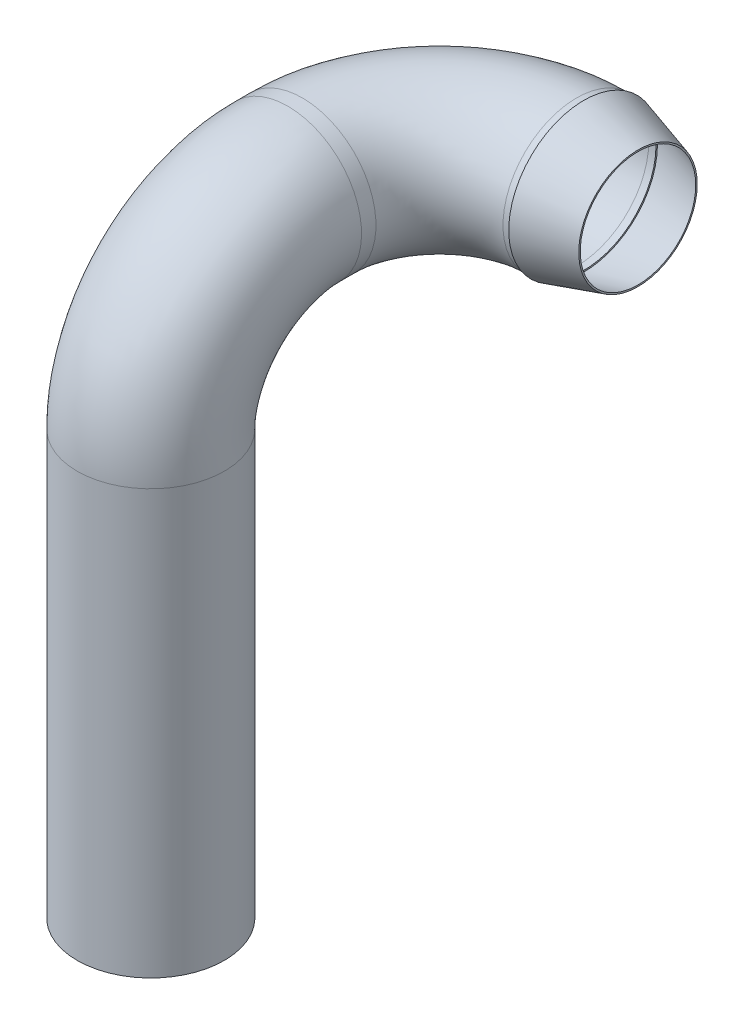
ISO-10303-21;
HEADER;
FILE_DESCRIPTION(('STEP AP214'),'2;1');
FILE_NAME('part.step','',(''),(''),'','','');
FILE_SCHEMA(('AUTOMOTIVE_DESIGN { 1 0 10303 214 1 1 1 1 }'));
ENDSEC;
DATA;
#1=APPLICATION_CONTEXT('core data for automotive mechanical design processes');
#2=APPLICATION_PROTOCOL_DEFINITION('international standard','automotive_design',2000,#1);
#3=PRODUCT_CONTEXT('',#1,'mechanical');
#4=PRODUCT('Part','Part','',(#3));
#5=PRODUCT_RELATED_PRODUCT_CATEGORY('part','',(#4));
#6=PRODUCT_DEFINITION_FORMATION('','',#4);
#7=PRODUCT_DEFINITION_CONTEXT('part definition',#1,'design');
#8=PRODUCT_DEFINITION('design','',#6,#7);
#9=PRODUCT_DEFINITION_SHAPE('','',#8);
#10=(LENGTH_UNIT() NAMED_UNIT(*) SI_UNIT(.MILLI.,.METRE.));
#11=(NAMED_UNIT(*) PLANE_ANGLE_UNIT() SI_UNIT($,.RADIAN.));
#12=(NAMED_UNIT(*) SI_UNIT($,.STERADIAN.) SOLID_ANGLE_UNIT());
#13=UNCERTAINTY_MEASURE_WITH_UNIT(LENGTH_MEASURE(1.E-05),#10,'distance_accuracy_value','');
#14=(GEOMETRIC_REPRESENTATION_CONTEXT(3) GLOBAL_UNCERTAINTY_ASSIGNED_CONTEXT((#13)) GLOBAL_UNIT_ASSIGNED_CONTEXT((#10,
#11,#12)) REPRESENTATION_CONTEXT('',''));
#15=CARTESIAN_POINT('',(0.,0.,0.));
#16=DIRECTION('',(0.,0.,1.));
#17=DIRECTION('',(1.,0.,0.));
#18=AXIS2_PLACEMENT_3D('',#15,#16,#17);
#19=CARTESIAN_POINT('',(199.999999999999,777.,-400.));
#20=DIRECTION('',(1.,0.,0.));
#21=DIRECTION('',(0.,0.,-1.));
#22=AXIS2_PLACEMENT_3D('',#19,#20,#21);
#23=PLANE('',#22);
#24=CARTESIAN_POINT('',(199.999999999999,777.,-400.));
#25=DIRECTION('',(1.,0.,0.));
#26=DIRECTION('',(0.,0.,-1.));
#27=AXIS2_PLACEMENT_3D('',#24,#25,#26);
#28=CIRCLE('',#27,104.084269123165);
#29=CARTESIAN_POINT('',(199.999999999999,777.,-504.084269123165));
#30=VERTEX_POINT('',#29);
#31=EDGE_CURVE('E70',#30,#30,#28,.T.);
#32=ORIENTED_EDGE('',*,*,#31,.F.);
#33=EDGE_LOOP('',(#32));
#34=FACE_BOUND('',#33,.T.);
#35=CARTESIAN_POINT('',(199.999999999999,777.,-400.));
#36=DIRECTION('',(1.,0.,0.));
#37=DIRECTION('',(0.,0.,-1.));
#38=AXIS2_PLACEMENT_3D('',#35,#36,#37);
#39=CIRCLE('',#38,102.);
#40=CARTESIAN_POINT('',(199.999999999999,777.,-502.));
#41=VERTEX_POINT('',#40);
#42=EDGE_CURVE('E78',#41,#41,#39,.T.);
#43=ORIENTED_EDGE('',*,*,#42,.T.);
#44=EDGE_LOOP('',(#43));
#45=FACE_BOUND('',#44,.T.);
#46=ADVANCED_FACE('F63',(#34,#45),#23,.F.);
#47=CARTESIAN_POINT('',(274.999999999999,777.,-400.));
#48=DIRECTION('',(1.,0.,0.));
#49=DIRECTION('',(0.,0.,-1.));
#50=AXIS2_PLACEMENT_3D('',#47,#48,#49);
#51=PLANE('',#50);
#52=CARTESIAN_POINT('',(274.999999999999,777.,-400.));
#53=DIRECTION('',(1.,0.,0.));
#54=DIRECTION('',(0.,0.,-1.));
#55=AXIS2_PLACEMENT_3D('',#52,#53,#54);
#56=CIRCLE('',#55,80.);
#57=CARTESIAN_POINT('',(274.999999999999,777.,-480.));
#58=VERTEX_POINT('',#57);
#59=EDGE_CURVE('E74',#58,#58,#56,.T.);
#60=ORIENTED_EDGE('',*,*,#59,.F.);
#61=EDGE_LOOP('',(#60));
#62=FACE_BOUND('',#61,.T.);
#63=CARTESIAN_POINT('',(274.999999999999,777.,-400.));
#64=DIRECTION('',(1.,0.,0.));
#65=DIRECTION('',(0.,0.,-1.));
#66=AXIS2_PLACEMENT_3D('',#63,#64,#65);
#67=CIRCLE('',#66,82.0842691231647);
#68=CARTESIAN_POINT('',(274.999999999999,777.,-482.084269123165));
#69=VERTEX_POINT('',#68);
#70=EDGE_CURVE('E12',#69,#69,#67,.T.);
#71=ORIENTED_EDGE('',*,*,#70,.T.);
#72=EDGE_LOOP('',(#71));
#73=FACE_BOUND('',#72,.T.);
#74=ADVANCED_FACE('F91',(#62,#73),#51,.T.);
#75=CARTESIAN_POINT('',(275.562947135901,777.,-400.));
#76=DIRECTION('',(-1.,0.,0.));
#77=DIRECTION('',(0.,0.,1.));
#78=AXIS2_PLACEMENT_3D('',#75,#76,#77);
#79=CONICAL_SURFACE('',#78,81.9191379633003,0.285329420182135);
#80=ORIENTED_EDGE('',*,*,#31,.T.);
#81=EDGE_LOOP('',(#80));
#82=FACE_BOUND('',#81,.T.);
#83=ORIENTED_EDGE('',*,*,#70,.F.);
#84=EDGE_LOOP('',(#83));
#85=FACE_BOUND('',#84,.T.);
#86=ADVANCED_FACE('F65',(#82,#85),#79,.T.);
#87=CARTESIAN_POINT('',(274.999999999999,777.,-400.));
#88=DIRECTION('',(-1.,0.,0.));
#89=DIRECTION('',(0.,0.,1.));
#90=AXIS2_PLACEMENT_3D('',#87,#88,#89);
#91=CONICAL_SURFACE('',#90,80.,0.285329420182135);
#92=ORIENTED_EDGE('',*,*,#42,.F.);
#93=EDGE_LOOP('',(#92));
#94=FACE_BOUND('',#93,.T.);
#95=ORIENTED_EDGE('',*,*,#59,.T.);
#96=EDGE_LOOP('',(#95));
#97=FACE_BOUND('',#96,.T.);
#98=ADVANCED_FACE('F85',(#94,#97),#91,.F.);
#99=CLOSED_SHELL('',(#46,#74,#86,#98));
#100=MANIFOLD_SOLID_BREP('B2',#99);
#101=CARTESIAN_POINT('',(0.,0.,0.));
#102=DIRECTION('',(0.,1.,0.));
#103=DIRECTION('',(0.,0.,1.));
#104=AXIS2_PLACEMENT_3D('',#101,#102,#103);
#105=PLANE('',#104);
#106=CARTESIAN_POINT('',(0.,0.,0.));
#107=DIRECTION('',(0.,1.,0.));
#108=DIRECTION('',(0.,0.,1.));
#109=AXIS2_PLACEMENT_3D('',#106,#107,#108);
#110=CIRCLE('',#109,100.);
#111=CARTESIAN_POINT('',(0.,0.,100.));
#112=VERTEX_POINT('',#111);
#113=EDGE_CURVE('E257',#112,#112,#110,.T.);
#114=ORIENTED_EDGE('',*,*,#113,.T.);
#115=EDGE_LOOP('',(#114));
#116=FACE_BOUND('',#115,.T.);
#117=CARTESIAN_POINT('',(0.,0.,0.));
#118=DIRECTION('',(0.,1.,0.));
#119=DIRECTION('',(0.,0.,1.));
#120=AXIS2_PLACEMENT_3D('',#117,#118,#119);
#121=CIRCLE('',#120,102.);
#122=CARTESIAN_POINT('',(0.,0.,102.));
#123=VERTEX_POINT('',#122);
#124=EDGE_CURVE('E144',#123,#123,#121,.T.);
#125=ORIENTED_EDGE('',*,*,#124,.F.);
#126=EDGE_LOOP('',(#125));
#127=FACE_BOUND('',#126,.T.);
#128=ADVANCED_FACE('F125',(#116,#127),#105,.F.);
#129=CARTESIAN_POINT('',(199.999999999999,777.,-400.));
#130=DIRECTION('',(1.,0.,0.));
#131=DIRECTION('',(0.,1.,0.));
#132=AXIS2_PLACEMENT_3D('',#129,#130,#131);
#133=PLANE('',#132);
#134=CARTESIAN_POINT('',(199.999999999999,777.,-400.));
#135=DIRECTION('',(1.,0.,0.));
#136=DIRECTION('',(0.,1.,0.));
#137=AXIS2_PLACEMENT_3D('',#134,#135,#136);
#138=CIRCLE('',#137,100.);
#139=CARTESIAN_POINT('',(199.999999999999,877.,-400.));
#140=VERTEX_POINT('',#139);
#141=EDGE_CURVE('E147',#140,#140,#138,.T.);
#142=ORIENTED_EDGE('',*,*,#141,.F.);
#143=EDGE_LOOP('',(#142));
#144=FACE_BOUND('',#143,.T.);
#145=CARTESIAN_POINT('',(199.999999999999,777.,-400.));
#146=DIRECTION('',(1.,0.,0.));
#147=DIRECTION('',(0.,0.,-1.));
#148=AXIS2_PLACEMENT_3D('',#145,#146,#147);
#149=CIRCLE('',#148,102.);
#150=CARTESIAN_POINT('',(199.999999999999,777.,-502.));
#151=VERTEX_POINT('',#150);
#152=EDGE_CURVE('E62',#151,#151,#149,.T.);
#153=ORIENTED_EDGE('',*,*,#152,.T.);
#154=EDGE_LOOP('',(#153));
#155=FACE_BOUND('',#154,.T.);
#156=ADVANCED_FACE('F174',(#144,#155),#133,.T.);
#157=CARTESIAN_POINT('',(0.,0.,0.));
#158=DIRECTION('',(0.,1.,0.));
#159=DIRECTION('',(0.,0.,1.));
#160=AXIS2_PLACEMENT_3D('',#157,#158,#159);
#161=CYLINDRICAL_SURFACE('',#160,102.);
#162=CARTESIAN_POINT('',(0.,587.000000000001,0.));
#163=DIRECTION('',(0.,-1.,0.));
#164=DIRECTION('',(0.,0.,-1.));
#165=AXIS2_PLACEMENT_3D('',#162,#163,#164);
#166=CIRCLE('',#165,102.);
#167=CARTESIAN_POINT('',(0.,587.000000000001,102.));
#168=VERTEX_POINT('',#167);
#169=EDGE_CURVE('E146',#168,#168,#166,.F.);
#170=ORIENTED_EDGE('',*,*,#169,.F.);
#171=EDGE_LOOP('',(#170));
#172=FACE_BOUND('',#171,.T.);
#173=ORIENTED_EDGE('',*,*,#124,.T.);
#174=EDGE_LOOP('',(#173));
#175=FACE_BOUND('',#174,.T.);
#176=ADVANCED_FACE('F169',(#172,#175),#161,.T.);
#177=CARTESIAN_POINT('',(0.,587.000000000001,-190.));
#178=DIRECTION('',(-1.,0.,0.));
#179=DIRECTION('',(0.,0.,1.));
#180=AXIS2_PLACEMENT_3D('',#177,#178,#179);
#181=TOROIDAL_SURFACE('',#180,190.,102.);
#182=CARTESIAN_POINT('',(0.,777.,-190.000000000001));
#183=DIRECTION('',(0.,0.,-1.));
#184=DIRECTION('',(-1.,0.,0.));
#185=AXIS2_PLACEMENT_3D('',#182,#183,#184);
#186=CIRCLE('',#185,102.);
#187=CARTESIAN_POINT('',(0.,879.,-190.000000000001));
#188=VERTEX_POINT('',#187);
#189=EDGE_CURVE('E141',#188,#188,#186,.T.);
#190=CARTESIAN_POINT('',(0.,587.000000000001,-190.));
#191=DIRECTION('',(-1.,0.,0.));
#192=DIRECTION('',(0.,0.,1.));
#193=AXIS2_PLACEMENT_3D('',#190,#191,#192);
#194=CIRCLE('',#193,292.);
#195=EDGE_CURVE('',#168,#188,#194,.T.);
#196=ORIENTED_EDGE('',*,*,#169,.T.);
#197=ORIENTED_EDGE('',*,*,#189,.F.);
#198=ORIENTED_EDGE('',*,*,#195,.T.);
#199=ORIENTED_EDGE('',*,*,#195,.F.);
#200=EDGE_LOOP('',(#196,#198,#197,#199));
#201=FACE_BOUND('',#200,.T.);
#202=ADVANCED_FACE('F166',(#201),#181,.T.);
#203=CARTESIAN_POINT('',(0.,777.,-190.000000000001));
#204=DIRECTION('',(0.,0.,-1.));
#205=DIRECTION('',(-1.,0.,0.));
#206=AXIS2_PLACEMENT_3D('',#203,#204,#205);
#207=CYLINDRICAL_SURFACE('',#206,102.);
#208=CARTESIAN_POINT('',(0.,777.,-210.));
#209=DIRECTION('',(0.,0.,1.));
#210=DIRECTION('',(1.,0.,0.));
#211=AXIS2_PLACEMENT_3D('',#208,#209,#210);
#212=CIRCLE('',#211,102.);
#213=CARTESIAN_POINT('',(-102.,777.,-210.));
#214=VERTEX_POINT('',#213);
#215=EDGE_CURVE('E136',#214,#214,#212,.F.);
#216=ORIENTED_EDGE('',*,*,#215,.F.);
#217=EDGE_LOOP('',(#216));
#218=FACE_BOUND('',#217,.T.);
#219=ORIENTED_EDGE('',*,*,#189,.T.);
#220=EDGE_LOOP('',(#219));
#221=FACE_BOUND('',#220,.T.);
#222=ADVANCED_FACE('F164',(#218,#221),#207,.T.);
#223=CARTESIAN_POINT('',(190.,777.,-210.));
#224=DIRECTION('',(0.,-1.,0.));
#225=DIRECTION('',(0.,0.,-1.));
#226=AXIS2_PLACEMENT_3D('',#223,#224,#225);
#227=TOROIDAL_SURFACE('',#226,190.,102.);
#228=CARTESIAN_POINT('',(190.,777.,-400.));
#229=DIRECTION('',(1.,0.,0.));
#230=DIRECTION('',(0.,0.,-1.));
#231=AXIS2_PLACEMENT_3D('',#228,#229,#230);
#232=CIRCLE('',#231,102.);
#233=CARTESIAN_POINT('',(190.,777.,-502.));
#234=VERTEX_POINT('',#233);
#235=EDGE_CURVE('E132',#234,#234,#232,.T.);
#236=CARTESIAN_POINT('',(190.,777.,-210.));
#237=DIRECTION('',(0.,-1.,0.));
#238=DIRECTION('',(0.,0.,-1.));
#239=AXIS2_PLACEMENT_3D('',#236,#237,#238);
#240=CIRCLE('',#239,292.);
#241=EDGE_CURVE('',#214,#234,#240,.T.);
#242=ORIENTED_EDGE('',*,*,#215,.T.);
#243=ORIENTED_EDGE('',*,*,#235,.F.);
#244=ORIENTED_EDGE('',*,*,#241,.T.);
#245=ORIENTED_EDGE('',*,*,#241,.F.);
#246=EDGE_LOOP('',(#242,#244,#243,#245));
#247=FACE_BOUND('',#246,.T.);
#248=ADVANCED_FACE('F184',(#247),#227,.T.);
#249=CARTESIAN_POINT('',(190.,777.,-400.));
#250=DIRECTION('',(1.,0.,0.));
#251=DIRECTION('',(0.,0.,-1.));
#252=AXIS2_PLACEMENT_3D('',#249,#250,#251);
#253=CYLINDRICAL_SURFACE('',#252,102.);
#254=ORIENTED_EDGE('',*,*,#152,.F.);
#255=EDGE_LOOP('',(#254));
#256=FACE_BOUND('',#255,.T.);
#257=ORIENTED_EDGE('',*,*,#235,.T.);
#258=EDGE_LOOP('',(#257));
#259=FACE_BOUND('',#258,.T.);
#260=ADVANCED_FACE('F127',(#256,#259),#253,.T.);
#261=CARTESIAN_POINT('',(0.,0.,0.));
#262=DIRECTION('',(0.,1.,0.));
#263=DIRECTION('',(0.,0.,1.));
#264=AXIS2_PLACEMENT_3D('',#261,#262,#263);
#265=CYLINDRICAL_SURFACE('',#264,100.);
#266=CARTESIAN_POINT('',(0.,587.000000000001,0.));
#267=DIRECTION('',(0.,1.,0.));
#268=DIRECTION('',(0.,0.,1.));
#269=AXIS2_PLACEMENT_3D('',#266,#267,#268);
#270=CIRCLE('',#269,100.);
#271=CARTESIAN_POINT('',(0.,587.000000000001,100.));
#272=VERTEX_POINT('',#271);
#273=EDGE_CURVE('E256',#272,#272,#270,.T.);
#274=ORIENTED_EDGE('',*,*,#273,.T.);
#275=EDGE_LOOP('',(#274));
#276=FACE_BOUND('',#275,.T.);
#277=ORIENTED_EDGE('',*,*,#113,.F.);
#278=EDGE_LOOP('',(#277));
#279=FACE_BOUND('',#278,.T.);
#280=ADVANCED_FACE('F183',(#276,#279),#265,.F.);
#281=CARTESIAN_POINT('',(0.,587.000000000001,-190.));
#282=DIRECTION('',(-1.,0.,0.));
#283=DIRECTION('',(0.,0.,1.));
#284=AXIS2_PLACEMENT_3D('',#281,#282,#283);
#285=TOROIDAL_SURFACE('',#284,190.,100.);
#286=CARTESIAN_POINT('',(0.,777.,-190.000000000001));
#287=DIRECTION('',(0.,0.,-1.));
#288=DIRECTION('',(0.,1.,0.));
#289=AXIS2_PLACEMENT_3D('',#286,#287,#288);
#290=CIRCLE('',#289,100.);
#291=CARTESIAN_POINT('',(0.,877.,-190.000000000001));
#292=VERTEX_POINT('',#291);
#293=EDGE_CURVE('E253',#292,#292,#290,.T.);
#294=CARTESIAN_POINT('',(0.,587.000000000001,-190.));
#295=DIRECTION('',(-1.,0.,0.));
#296=DIRECTION('',(0.,0.,1.));
#297=AXIS2_PLACEMENT_3D('',#294,#295,#296);
#298=CIRCLE('',#297,290.);
#299=EDGE_CURVE('',#272,#292,#298,.T.);
#300=ORIENTED_EDGE('',*,*,#273,.F.);
#301=ORIENTED_EDGE('',*,*,#293,.T.);
#302=ORIENTED_EDGE('',*,*,#299,.T.);
#303=ORIENTED_EDGE('',*,*,#299,.F.);
#304=EDGE_LOOP('',(#300,#302,#301,#303));
#305=FACE_BOUND('',#304,.T.);
#306=ADVANCED_FACE('F190',(#305),#285,.F.);
#307=CARTESIAN_POINT('',(0.,777.,-190.000000000001));
#308=DIRECTION('',(0.,0.,-1.));
#309=DIRECTION('',(-1.,0.,0.));
#310=AXIS2_PLACEMENT_3D('',#307,#308,#309);
#311=CYLINDRICAL_SURFACE('',#310,100.);
#312=CARTESIAN_POINT('',(0.,777.,-210.));
#313=DIRECTION('',(0.,0.,-1.));
#314=DIRECTION('',(0.,1.,0.));
#315=AXIS2_PLACEMENT_3D('',#312,#313,#314);
#316=CIRCLE('',#315,100.);
#317=CARTESIAN_POINT('',(-100.,777.,-210.));
#318=VERTEX_POINT('',#317);
#319=EDGE_CURVE('E158',#318,#318,#316,.T.);
#320=ORIENTED_EDGE('',*,*,#319,.T.);
#321=EDGE_LOOP('',(#320));
#322=FACE_BOUND('',#321,.T.);
#323=ORIENTED_EDGE('',*,*,#293,.F.);
#324=EDGE_LOOP('',(#323));
#325=FACE_BOUND('',#324,.T.);
#326=ADVANCED_FACE('F238',(#322,#325),#311,.F.);
#327=CARTESIAN_POINT('',(190.,777.,-210.));
#328=DIRECTION('',(0.,-1.,0.));
#329=DIRECTION('',(0.,0.,-1.));
#330=AXIS2_PLACEMENT_3D('',#327,#328,#329);
#331=TOROIDAL_SURFACE('',#330,190.,100.);
#332=CARTESIAN_POINT('',(190.,777.,-400.));
#333=DIRECTION('',(1.,0.,0.));
#334=DIRECTION('',(0.,1.,0.));
#335=AXIS2_PLACEMENT_3D('',#332,#333,#334);
#336=CIRCLE('',#335,100.);
#337=CARTESIAN_POINT('',(190.,777.,-500.));
#338=VERTEX_POINT('',#337);
#339=EDGE_CURVE('E153',#338,#338,#336,.T.);
#340=CARTESIAN_POINT('',(190.,777.,-210.));
#341=DIRECTION('',(0.,-1.,0.));
#342=DIRECTION('',(0.,0.,-1.));
#343=AXIS2_PLACEMENT_3D('',#340,#341,#342);
#344=CIRCLE('',#343,290.);
#345=EDGE_CURVE('',#318,#338,#344,.T.);
#346=ORIENTED_EDGE('',*,*,#319,.F.);
#347=ORIENTED_EDGE('',*,*,#339,.T.);
#348=ORIENTED_EDGE('',*,*,#345,.T.);
#349=ORIENTED_EDGE('',*,*,#345,.F.);
#350=EDGE_LOOP('',(#346,#348,#347,#349));
#351=FACE_BOUND('',#350,.T.);
#352=ADVANCED_FACE('F233',(#351),#331,.F.);
#353=CARTESIAN_POINT('',(190.,777.,-400.));
#354=DIRECTION('',(1.,0.,0.));
#355=DIRECTION('',(0.,0.,-1.));
#356=AXIS2_PLACEMENT_3D('',#353,#354,#355);
#357=CYLINDRICAL_SURFACE('',#356,100.);
#358=ORIENTED_EDGE('',*,*,#141,.T.);
#359=EDGE_LOOP('',(#358));
#360=FACE_BOUND('',#359,.T.);
#361=ORIENTED_EDGE('',*,*,#339,.F.);
#362=EDGE_LOOP('',(#361));
#363=FACE_BOUND('',#362,.T.);
#364=ADVANCED_FACE('F226',(#360,#363),#357,.F.);
#365=CLOSED_SHELL('',(#128,#156,#176,#202,#222,#248,#260,#280,#306,#326,#352,#364));
#366=MANIFOLD_SOLID_BREP('B7',#365);
#367=ADVANCED_BREP_SHAPE_REPRESENTATION('',(#18,#100,#366),#14);
#368=SHAPE_DEFINITION_REPRESENTATION(#9,#367);
ENDSEC;
END-ISO-10303-21;
